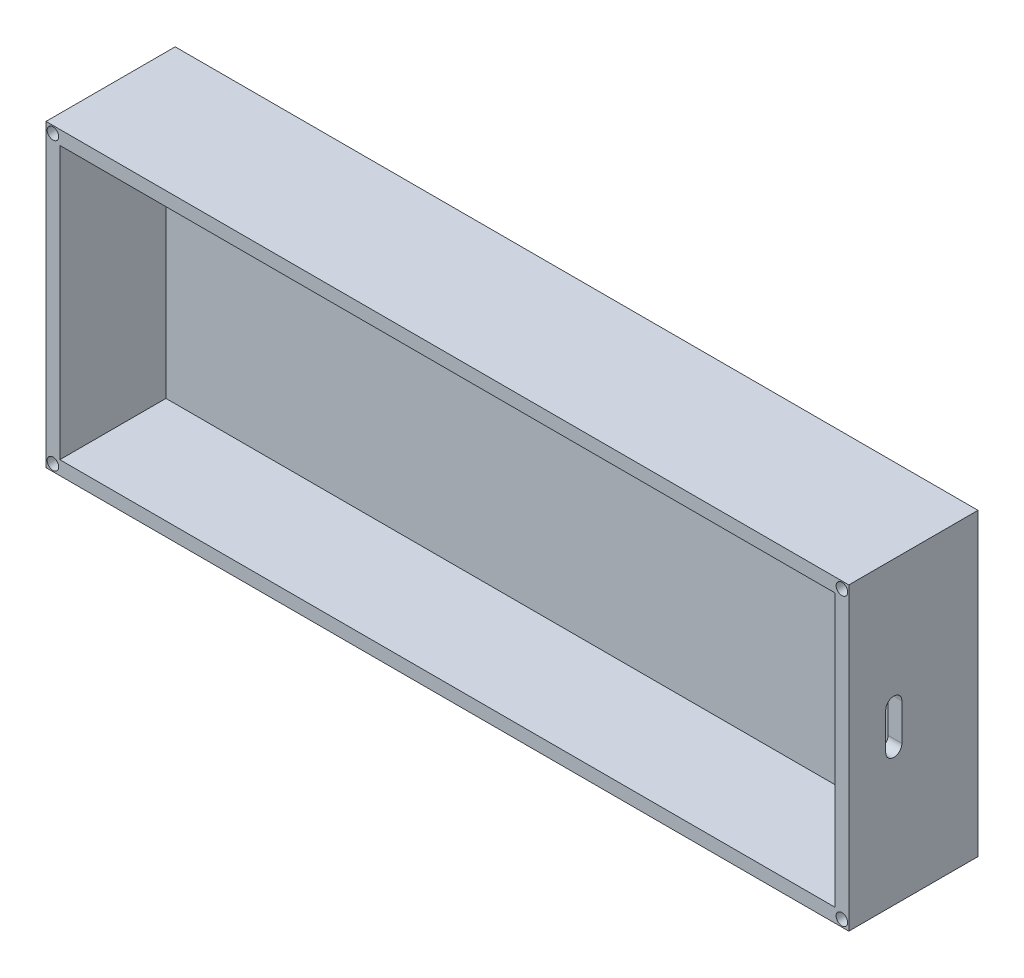
ISO-10303-21;
HEADER;
FILE_DESCRIPTION(('STEP AP214'),'2;1');
FILE_NAME('part.step','',(''),(''),'','','');
FILE_SCHEMA(('AUTOMOTIVE_DESIGN { 1 0 10303 214 1 1 1 1 }'));
ENDSEC;
DATA;
#1=APPLICATION_CONTEXT('core data for automotive mechanical design processes');
#2=APPLICATION_PROTOCOL_DEFINITION('international standard','automotive_design',2000,#1);
#3=PRODUCT_CONTEXT('',#1,'mechanical');
#4=PRODUCT('Part','Part','',(#3));
#5=PRODUCT_RELATED_PRODUCT_CATEGORY('part','',(#4));
#6=PRODUCT_DEFINITION_FORMATION('','',#4);
#7=PRODUCT_DEFINITION_CONTEXT('part definition',#1,'design');
#8=PRODUCT_DEFINITION('design','',#6,#7);
#9=PRODUCT_DEFINITION_SHAPE('','',#8);
#10=(LENGTH_UNIT() NAMED_UNIT(*) SI_UNIT(.MILLI.,.METRE.));
#11=(NAMED_UNIT(*) PLANE_ANGLE_UNIT() SI_UNIT($,.RADIAN.));
#12=(NAMED_UNIT(*) SI_UNIT($,.STERADIAN.) SOLID_ANGLE_UNIT());
#13=UNCERTAINTY_MEASURE_WITH_UNIT(LENGTH_MEASURE(1.E-05),#10,'distance_accuracy_value','');
#14=(GEOMETRIC_REPRESENTATION_CONTEXT(3) GLOBAL_UNCERTAINTY_ASSIGNED_CONTEXT((#13)) GLOBAL_UNIT_ASSIGNED_CONTEXT((#10,
#11,#12)) REPRESENTATION_CONTEXT('',''));
#15=CARTESIAN_POINT('',(0.,0.,0.));
#16=DIRECTION('',(0.,0.,1.));
#17=DIRECTION('',(1.,0.,0.));
#18=AXIS2_PLACEMENT_3D('',#15,#16,#17);
#19=CARTESIAN_POINT('',(-87.,-32.5,5.));
#20=DIRECTION('',(1.,0.,0.));
#21=DIRECTION('',(0.,0.,-1.));
#22=AXIS2_PLACEMENT_3D('',#19,#20,#21);
#23=PLANE('',#22);
#24=DIRECTION('',(0.,-1.,0.));
#25=VECTOR('',#24,1.);
#26=CARTESIAN_POINT('',(-87.,-32.5,0.));
#27=LINE('',#26,#25);
#28=CARTESIAN_POINT('',(-87.,32.5,0.));
#29=VERTEX_POINT('',#28);
#30=CARTESIAN_POINT('',(-87.,-32.5,0.));
#31=VERTEX_POINT('',#30);
#32=EDGE_CURVE('E197',#29,#31,#27,.T.);
#33=ORIENTED_EDGE('',*,*,#32,.T.);
#34=DIRECTION('',(0.,0.,-1.));
#35=VECTOR('',#34,1.);
#36=CARTESIAN_POINT('',(-87.,-32.5,5.));
#37=LINE('',#36,#35);
#38=CARTESIAN_POINT('',(-87.,-32.5,28.));
#39=VERTEX_POINT('',#38);
#40=EDGE_CURVE('E215',#39,#31,#37,.T.);
#41=ORIENTED_EDGE('',*,*,#40,.F.);
#42=DIRECTION('',(0.,-1.,0.));
#43=VECTOR('',#42,1.);
#44=CARTESIAN_POINT('',(-87.,0.,28.));
#45=LINE('',#44,#43);
#46=CARTESIAN_POINT('',(-87.,32.5,28.));
#47=VERTEX_POINT('',#46);
#48=EDGE_CURVE('E170',#47,#39,#45,.T.);
#49=ORIENTED_EDGE('',*,*,#48,.F.);
#50=DIRECTION('',(0.,0.,-1.));
#51=VECTOR('',#50,1.);
#52=CARTESIAN_POINT('',(-87.,32.5,5.));
#53=LINE('',#52,#51);
#54=EDGE_CURVE('E206',#47,#29,#53,.T.);
#55=ORIENTED_EDGE('',*,*,#54,.T.);
#56=EDGE_LOOP('',(#33,#41,#49,#55));
#57=FACE_BOUND('',#56,.T.);
#58=ADVANCED_FACE('F38',(#57),#23,.F.);
#59=CARTESIAN_POINT('',(87.,-32.5,5.));
#60=DIRECTION('',(0.,1.,0.));
#61=DIRECTION('',(-1.,0.,0.));
#62=AXIS2_PLACEMENT_3D('',#59,#60,#61);
#63=PLANE('',#62);
#64=DIRECTION('',(1.,0.,0.));
#65=VECTOR('',#64,1.);
#66=CARTESIAN_POINT('',(87.,-32.5,0.));
#67=LINE('',#66,#65);
#68=CARTESIAN_POINT('',(87.,-32.5,0.));
#69=VERTEX_POINT('',#68);
#70=EDGE_CURVE('E200',#31,#69,#67,.T.);
#71=ORIENTED_EDGE('',*,*,#70,.T.);
#72=DIRECTION('',(0.,0.,-1.));
#73=VECTOR('',#72,1.);
#74=CARTESIAN_POINT('',(87.,-32.5,5.));
#75=LINE('',#74,#73);
#76=CARTESIAN_POINT('',(87.,-32.5,28.));
#77=VERTEX_POINT('',#76);
#78=EDGE_CURVE('E212',#77,#69,#75,.T.);
#79=ORIENTED_EDGE('',*,*,#78,.F.);
#80=DIRECTION('',(1.,0.,0.));
#81=VECTOR('',#80,1.);
#82=CARTESIAN_POINT('',(0.,-32.5,28.));
#83=LINE('',#82,#81);
#84=EDGE_CURVE('E173',#39,#77,#83,.T.);
#85=ORIENTED_EDGE('',*,*,#84,.F.);
#86=ORIENTED_EDGE('',*,*,#40,.T.);
#87=EDGE_LOOP('',(#71,#79,#85,#86));
#88=FACE_BOUND('',#87,.T.);
#89=ADVANCED_FACE('F280',(#88),#63,.F.);
#90=CARTESIAN_POINT('',(87.,-32.5,5.));
#91=DIRECTION('',(-1.,0.,0.));
#92=DIRECTION('',(0.,0.,1.));
#93=AXIS2_PLACEMENT_3D('',#90,#91,#92);
#94=PLANE('',#93);
#95=DIRECTION('',(0.,1.,0.));
#96=VECTOR('',#95,1.);
#97=CARTESIAN_POINT('',(87.,-2.99999999999999,16.5));
#98=LINE('',#97,#96);
#99=CARTESIAN_POINT('',(87.,-2.99999999999999,16.5));
#100=VERTEX_POINT('',#99);
#101=CARTESIAN_POINT('',(87.,5.00000000000001,16.5));
#102=VERTEX_POINT('',#101);
#103=EDGE_CURVE('E137',#100,#102,#98,.T.);
#104=ORIENTED_EDGE('',*,*,#103,.F.);
#105=CARTESIAN_POINT('',(87.,-2.99999999999999,18.25));
#106=DIRECTION('',(1.,0.,0.));
#107=DIRECTION('',(0.,0.,-1.));
#108=AXIS2_PLACEMENT_3D('',#105,#106,#107);
#109=CIRCLE('',#108,1.75);
#110=CARTESIAN_POINT('',(87.,-2.99999999999999,20.));
#111=VERTEX_POINT('',#110);
#112=EDGE_CURVE('E52',#111,#100,#109,.T.);
#113=ORIENTED_EDGE('',*,*,#112,.F.);
#114=DIRECTION('',(0.,-1.,0.));
#115=VECTOR('',#114,1.);
#116=CARTESIAN_POINT('',(87.,-2.99999999999999,20.));
#117=LINE('',#116,#115);
#118=CARTESIAN_POINT('',(87.,5.00000000000001,20.));
#119=VERTEX_POINT('',#118);
#120=EDGE_CURVE('E144',#119,#111,#117,.T.);
#121=ORIENTED_EDGE('',*,*,#120,.F.);
#122=CARTESIAN_POINT('',(87.,5.00000000000001,18.25));
#123=DIRECTION('',(1.,0.,0.));
#124=DIRECTION('',(0.,0.,-1.));
#125=AXIS2_PLACEMENT_3D('',#122,#123,#124);
#126=CIRCLE('',#125,1.75);
#127=EDGE_CURVE('E128',#102,#119,#126,.T.);
#128=ORIENTED_EDGE('',*,*,#127,.F.);
#129=EDGE_LOOP('',(#104,#113,#121,#128));
#130=FACE_BOUND('',#129,.T.);
#131=DIRECTION('',(0.,1.,0.));
#132=VECTOR('',#131,1.);
#133=CARTESIAN_POINT('',(87.,-32.5,0.));
#134=LINE('',#133,#132);
#135=CARTESIAN_POINT('',(87.,32.5,0.));
#136=VERTEX_POINT('',#135);
#137=EDGE_CURVE('E202',#69,#136,#134,.T.);
#138=ORIENTED_EDGE('',*,*,#137,.T.);
#139=DIRECTION('',(0.,0.,-1.));
#140=VECTOR('',#139,1.);
#141=CARTESIAN_POINT('',(87.,32.5,5.));
#142=LINE('',#141,#140);
#143=CARTESIAN_POINT('',(87.,32.5,28.));
#144=VERTEX_POINT('',#143);
#145=EDGE_CURVE('E209',#144,#136,#142,.T.);
#146=ORIENTED_EDGE('',*,*,#145,.F.);
#147=DIRECTION('',(0.,1.,0.));
#148=VECTOR('',#147,1.);
#149=CARTESIAN_POINT('',(87.,0.,28.));
#150=LINE('',#149,#148);
#151=EDGE_CURVE('E176',#77,#144,#150,.T.);
#152=ORIENTED_EDGE('',*,*,#151,.F.);
#153=ORIENTED_EDGE('',*,*,#78,.T.);
#154=EDGE_LOOP('',(#138,#146,#152,#153));
#155=FACE_BOUND('',#154,.T.);
#156=ADVANCED_FACE('F141',(#130,#155),#94,.F.);
#157=CARTESIAN_POINT('',(87.,32.5,5.));
#158=DIRECTION('',(0.,-1.,0.));
#159=DIRECTION('',(1.,0.,0.));
#160=AXIS2_PLACEMENT_3D('',#157,#158,#159);
#161=PLANE('',#160);
#162=DIRECTION('',(-1.,0.,0.));
#163=VECTOR('',#162,1.);
#164=CARTESIAN_POINT('',(87.,32.5,0.));
#165=LINE('',#164,#163);
#166=EDGE_CURVE('E204',#136,#29,#165,.T.);
#167=ORIENTED_EDGE('',*,*,#166,.T.);
#168=ORIENTED_EDGE('',*,*,#54,.F.);
#169=DIRECTION('',(-1.,0.,0.));
#170=VECTOR('',#169,1.);
#171=CARTESIAN_POINT('',(0.,32.5,28.));
#172=LINE('',#171,#170);
#173=EDGE_CURVE('E167',#144,#47,#172,.T.);
#174=ORIENTED_EDGE('',*,*,#173,.F.);
#175=ORIENTED_EDGE('',*,*,#145,.T.);
#176=EDGE_LOOP('',(#167,#168,#174,#175));
#177=FACE_BOUND('',#176,.T.);
#178=ADVANCED_FACE('F275',(#177),#161,.F.);
#179=CARTESIAN_POINT('',(0.,0.,0.));
#180=DIRECTION('',(0.,0.,1.));
#181=DIRECTION('',(1.,0.,0.));
#182=AXIS2_PLACEMENT_3D('',#179,#180,#181);
#183=PLANE('',#182);
#184=ORIENTED_EDGE('',*,*,#32,.F.);
#185=ORIENTED_EDGE('',*,*,#166,.F.);
#186=ORIENTED_EDGE('',*,*,#137,.F.);
#187=ORIENTED_EDGE('',*,*,#70,.F.);
#188=EDGE_LOOP('',(#184,#185,#186,#187));
#189=FACE_BOUND('',#188,.T.);
#190=ADVANCED_FACE('F283',(#189),#183,.F.);
#191=CARTESIAN_POINT('',(0.,29.5,28.));
#192=DIRECTION('',(0.,-1.,0.));
#193=DIRECTION('',(1.,0.,0.));
#194=AXIS2_PLACEMENT_3D('',#191,#192,#193);
#195=PLANE('',#194);
#196=DIRECTION('',(-1.,0.,0.));
#197=VECTOR('',#196,1.);
#198=CARTESIAN_POINT('',(0.,29.5,5.));
#199=LINE('',#198,#197);
#200=CARTESIAN_POINT('',(84.,29.5,5.));
#201=VERTEX_POINT('',#200);
#202=CARTESIAN_POINT('',(-84.,29.5,5.));
#203=VERTEX_POINT('',#202);
#204=EDGE_CURVE('E151',#201,#203,#199,.T.);
#205=ORIENTED_EDGE('',*,*,#204,.F.);
#206=DIRECTION('',(0.,0.,-1.));
#207=VECTOR('',#206,1.);
#208=CARTESIAN_POINT('',(84.,29.5,28.));
#209=LINE('',#208,#207);
#210=CARTESIAN_POINT('',(84.,29.5,28.));
#211=VERTEX_POINT('',#210);
#212=EDGE_CURVE('E194',#211,#201,#209,.T.);
#213=ORIENTED_EDGE('',*,*,#212,.F.);
#214=DIRECTION('',(-1.,0.,0.));
#215=VECTOR('',#214,1.);
#216=CARTESIAN_POINT('',(0.,29.5,28.));
#217=LINE('',#216,#215);
#218=CARTESIAN_POINT('',(-84.,29.5,28.));
#219=VERTEX_POINT('',#218);
#220=EDGE_CURVE('E154',#211,#219,#217,.T.);
#221=ORIENTED_EDGE('',*,*,#220,.T.);
#222=DIRECTION('',(0.,0.,-1.));
#223=VECTOR('',#222,1.);
#224=CARTESIAN_POINT('',(-84.,29.5,28.));
#225=LINE('',#224,#223);
#226=EDGE_CURVE('E179',#219,#203,#225,.T.);
#227=ORIENTED_EDGE('',*,*,#226,.T.);
#228=EDGE_LOOP('',(#205,#213,#221,#227));
#229=FACE_BOUND('',#228,.T.);
#230=ADVANCED_FACE('F285',(#229),#195,.T.);
#231=CARTESIAN_POINT('',(84.,0.,28.));
#232=DIRECTION('',(-1.,0.,0.));
#233=DIRECTION('',(0.,0.,1.));
#234=AXIS2_PLACEMENT_3D('',#231,#232,#233);
#235=PLANE('',#234);
#236=CARTESIAN_POINT('',(84.,-2.99999999999999,18.25));
#237=DIRECTION('',(-1.,0.,0.));
#238=DIRECTION('',(0.,0.,1.));
#239=AXIS2_PLACEMENT_3D('',#236,#237,#238);
#240=CIRCLE('',#239,1.75);
#241=CARTESIAN_POINT('',(84.,-2.99999999999999,16.5));
#242=VERTEX_POINT('',#241);
#243=CARTESIAN_POINT('',(84.,-2.99999999999999,20.));
#244=VERTEX_POINT('',#243);
#245=EDGE_CURVE('E11',#242,#244,#240,.T.);
#246=ORIENTED_EDGE('',*,*,#245,.F.);
#247=DIRECTION('',(0.,-1.,0.));
#248=VECTOR('',#247,1.);
#249=CARTESIAN_POINT('',(84.,0.,16.5));
#250=LINE('',#249,#248);
#251=CARTESIAN_POINT('',(84.,5.00000000000001,16.5));
#252=VERTEX_POINT('',#251);
#253=EDGE_CURVE('E218',#252,#242,#250,.T.);
#254=ORIENTED_EDGE('',*,*,#253,.F.);
#255=CARTESIAN_POINT('',(84.,5.00000000000001,18.25));
#256=DIRECTION('',(-1.,0.,0.));
#257=DIRECTION('',(0.,0.,1.));
#258=AXIS2_PLACEMENT_3D('',#255,#256,#257);
#259=CIRCLE('',#258,1.75);
#260=CARTESIAN_POINT('',(84.,5.00000000000001,20.));
#261=VERTEX_POINT('',#260);
#262=EDGE_CURVE('E131',#261,#252,#259,.T.);
#263=ORIENTED_EDGE('',*,*,#262,.F.);
#264=DIRECTION('',(0.,1.,0.));
#265=VECTOR('',#264,1.);
#266=CARTESIAN_POINT('',(84.,0.,20.));
#267=LINE('',#266,#265);
#268=EDGE_CURVE('E45',#244,#261,#267,.T.);
#269=ORIENTED_EDGE('',*,*,#268,.F.);
#270=EDGE_LOOP('',(#246,#254,#263,#269));
#271=FACE_BOUND('',#270,.T.);
#272=DIRECTION('',(0.,1.,0.));
#273=VECTOR('',#272,1.);
#274=CARTESIAN_POINT('',(84.,0.,5.));
#275=LINE('',#274,#273);
#276=CARTESIAN_POINT('',(84.,-29.5,5.));
#277=VERTEX_POINT('',#276);
#278=EDGE_CURVE('E181',#277,#201,#275,.T.);
#279=ORIENTED_EDGE('',*,*,#278,.F.);
#280=DIRECTION('',(0.,0.,-1.));
#281=VECTOR('',#280,1.);
#282=CARTESIAN_POINT('',(84.,-29.5,28.));
#283=LINE('',#282,#281);
#284=CARTESIAN_POINT('',(84.,-29.5,28.));
#285=VERTEX_POINT('',#284);
#286=EDGE_CURVE('E191',#285,#277,#283,.T.);
#287=ORIENTED_EDGE('',*,*,#286,.F.);
#288=DIRECTION('',(0.,1.,0.));
#289=VECTOR('',#288,1.);
#290=CARTESIAN_POINT('',(84.,0.,28.));
#291=LINE('',#290,#289);
#292=EDGE_CURVE('E157',#285,#211,#291,.T.);
#293=ORIENTED_EDGE('',*,*,#292,.T.);
#294=ORIENTED_EDGE('',*,*,#212,.T.);
#295=EDGE_LOOP('',(#279,#287,#293,#294));
#296=FACE_BOUND('',#295,.T.);
#297=ADVANCED_FACE('F226',(#271,#296),#235,.T.);
#298=CARTESIAN_POINT('',(0.,-29.5,28.));
#299=DIRECTION('',(0.,1.,0.));
#300=DIRECTION('',(-1.,0.,0.));
#301=AXIS2_PLACEMENT_3D('',#298,#299,#300);
#302=PLANE('',#301);
#303=DIRECTION('',(1.,0.,0.));
#304=VECTOR('',#303,1.);
#305=CARTESIAN_POINT('',(0.,-29.5,5.));
#306=LINE('',#305,#304);
#307=CARTESIAN_POINT('',(-84.,-29.5,5.));
#308=VERTEX_POINT('',#307);
#309=EDGE_CURVE('E183',#308,#277,#306,.T.);
#310=ORIENTED_EDGE('',*,*,#309,.F.);
#311=DIRECTION('',(0.,0.,-1.));
#312=VECTOR('',#311,1.);
#313=CARTESIAN_POINT('',(-84.,-29.5,28.));
#314=LINE('',#313,#312);
#315=CARTESIAN_POINT('',(-84.,-29.5,28.));
#316=VERTEX_POINT('',#315);
#317=EDGE_CURVE('E188',#316,#308,#314,.T.);
#318=ORIENTED_EDGE('',*,*,#317,.F.);
#319=DIRECTION('',(1.,0.,0.));
#320=VECTOR('',#319,1.);
#321=CARTESIAN_POINT('',(0.,-29.5,28.));
#322=LINE('',#321,#320);
#323=EDGE_CURVE('E161',#316,#285,#322,.T.);
#324=ORIENTED_EDGE('',*,*,#323,.T.);
#325=ORIENTED_EDGE('',*,*,#286,.T.);
#326=EDGE_LOOP('',(#310,#318,#324,#325));
#327=FACE_BOUND('',#326,.T.);
#328=ADVANCED_FACE('F328',(#327),#302,.T.);
#329=CARTESIAN_POINT('',(-84.,0.,28.));
#330=DIRECTION('',(1.,0.,0.));
#331=DIRECTION('',(0.,0.,-1.));
#332=AXIS2_PLACEMENT_3D('',#329,#330,#331);
#333=PLANE('',#332);
#334=DIRECTION('',(0.,-1.,0.));
#335=VECTOR('',#334,1.);
#336=CARTESIAN_POINT('',(-84.,0.,5.));
#337=LINE('',#336,#335);
#338=EDGE_CURVE('E158',#203,#308,#337,.T.);
#339=ORIENTED_EDGE('',*,*,#338,.F.);
#340=ORIENTED_EDGE('',*,*,#226,.F.);
#341=DIRECTION('',(0.,-1.,0.));
#342=VECTOR('',#341,1.);
#343=CARTESIAN_POINT('',(-84.,0.,28.));
#344=LINE('',#343,#342);
#345=EDGE_CURVE('E164',#219,#316,#344,.T.);
#346=ORIENTED_EDGE('',*,*,#345,.T.);
#347=ORIENTED_EDGE('',*,*,#317,.T.);
#348=EDGE_LOOP('',(#339,#340,#346,#347));
#349=FACE_BOUND('',#348,.T.);
#350=ADVANCED_FACE('F261',(#349),#333,.T.);
#351=CARTESIAN_POINT('',(0.,0.,28.));
#352=DIRECTION('',(0.,0.,1.));
#353=DIRECTION('',(1.,0.,0.));
#354=AXIS2_PLACEMENT_3D('',#351,#352,#353);
#355=PLANE('',#354);
#356=CARTESIAN_POINT('',(85.5,-31.,28.));
#357=DIRECTION('',(0.,0.,1.));
#358=DIRECTION('',(1.,0.,0.));
#359=AXIS2_PLACEMENT_3D('',#356,#357,#358);
#360=CIRCLE('',#359,1.25);
#361=CARTESIAN_POINT('',(86.75,-31.,28.));
#362=VERTEX_POINT('',#361);
#363=EDGE_CURVE('E240',#362,#362,#360,.T.);
#364=ORIENTED_EDGE('',*,*,#363,.F.);
#365=EDGE_LOOP('',(#364));
#366=FACE_BOUND('',#365,.T.);
#367=CARTESIAN_POINT('',(85.5,31.,28.));
#368=DIRECTION('',(0.,0.,1.));
#369=DIRECTION('',(1.,0.,0.));
#370=AXIS2_PLACEMENT_3D('',#367,#368,#369);
#371=CIRCLE('',#370,1.25);
#372=CARTESIAN_POINT('',(86.75,31.,28.));
#373=VERTEX_POINT('',#372);
#374=EDGE_CURVE('E246',#373,#373,#371,.T.);
#375=ORIENTED_EDGE('',*,*,#374,.F.);
#376=EDGE_LOOP('',(#375));
#377=FACE_BOUND('',#376,.T.);
#378=CARTESIAN_POINT('',(-85.5,31.,28.));
#379=DIRECTION('',(0.,0.,1.));
#380=DIRECTION('',(1.,0.,0.));
#381=AXIS2_PLACEMENT_3D('',#378,#379,#380);
#382=CIRCLE('',#381,1.25);
#383=CARTESIAN_POINT('',(-84.25,31.,28.));
#384=VERTEX_POINT('',#383);
#385=EDGE_CURVE('E235',#384,#384,#382,.T.);
#386=ORIENTED_EDGE('',*,*,#385,.F.);
#387=EDGE_LOOP('',(#386));
#388=FACE_BOUND('',#387,.T.);
#389=CARTESIAN_POINT('',(-85.5,-31.,28.));
#390=DIRECTION('',(0.,0.,1.));
#391=DIRECTION('',(1.,0.,0.));
#392=AXIS2_PLACEMENT_3D('',#389,#390,#391);
#393=CIRCLE('',#392,1.25);
#394=CARTESIAN_POINT('',(-84.25,-31.,28.));
#395=VERTEX_POINT('',#394);
#396=EDGE_CURVE('E231',#395,#395,#393,.T.);
#397=ORIENTED_EDGE('',*,*,#396,.F.);
#398=EDGE_LOOP('',(#397));
#399=FACE_BOUND('',#398,.T.);
#400=ORIENTED_EDGE('',*,*,#220,.F.);
#401=ORIENTED_EDGE('',*,*,#292,.F.);
#402=ORIENTED_EDGE('',*,*,#323,.F.);
#403=ORIENTED_EDGE('',*,*,#345,.F.);
#404=EDGE_LOOP('',(#400,#401,#402,#403));
#405=FACE_BOUND('',#404,.T.);
#406=ORIENTED_EDGE('',*,*,#173,.T.);
#407=ORIENTED_EDGE('',*,*,#48,.T.);
#408=ORIENTED_EDGE('',*,*,#84,.T.);
#409=ORIENTED_EDGE('',*,*,#151,.T.);
#410=EDGE_LOOP('',(#406,#407,#408,#409));
#411=FACE_BOUND('',#410,.T.);
#412=ADVANCED_FACE('F257',(#366,#377,#388,#399,#405,#411),#355,.T.);
#413=CARTESIAN_POINT('',(0.,0.,5.));
#414=DIRECTION('',(0.,0.,1.));
#415=DIRECTION('',(1.,0.,0.));
#416=AXIS2_PLACEMENT_3D('',#413,#414,#415);
#417=PLANE('',#416);
#418=ORIENTED_EDGE('',*,*,#204,.T.);
#419=ORIENTED_EDGE('',*,*,#338,.T.);
#420=ORIENTED_EDGE('',*,*,#309,.T.);
#421=ORIENTED_EDGE('',*,*,#278,.T.);
#422=EDGE_LOOP('',(#418,#419,#420,#421));
#423=FACE_BOUND('',#422,.T.);
#424=ADVANCED_FACE('F260',(#423),#417,.T.);
#425=CARTESIAN_POINT('',(64.,-2.99999999999999,18.25));
#426=DIRECTION('',(1.,0.,0.));
#427=DIRECTION('',(0.,0.,-1.));
#428=AXIS2_PLACEMENT_3D('',#425,#426,#427);
#429=CYLINDRICAL_SURFACE('',#428,1.75);
#430=ORIENTED_EDGE('',*,*,#245,.T.);
#431=DIRECTION('',(1.,0.,0.));
#432=VECTOR('',#431,1.);
#433=CARTESIAN_POINT('',(64.,-2.99999999999999,20.));
#434=LINE('',#433,#432);
#435=EDGE_CURVE('E149',#244,#111,#434,.T.);
#436=ORIENTED_EDGE('',*,*,#435,.T.);
#437=ORIENTED_EDGE('',*,*,#112,.T.);
#438=DIRECTION('',(1.,0.,0.));
#439=VECTOR('',#438,1.);
#440=CARTESIAN_POINT('',(64.,-2.99999999999999,16.5));
#441=LINE('',#440,#439);
#442=EDGE_CURVE('E134',#242,#100,#441,.T.);
#443=ORIENTED_EDGE('',*,*,#442,.F.);
#444=EDGE_LOOP('',(#430,#436,#437,#443));
#445=FACE_BOUND('',#444,.T.);
#446=ADVANCED_FACE('F228',(#445),#429,.F.);
#447=CARTESIAN_POINT('',(64.,-2.99999999999999,20.));
#448=DIRECTION('',(0.,0.,1.));
#449=DIRECTION('',(1.,0.,0.));
#450=AXIS2_PLACEMENT_3D('',#447,#448,#449);
#451=PLANE('',#450);
#452=ORIENTED_EDGE('',*,*,#268,.T.);
#453=DIRECTION('',(1.,0.,0.));
#454=VECTOR('',#453,1.);
#455=CARTESIAN_POINT('',(64.,5.00000000000001,20.));
#456=LINE('',#455,#454);
#457=EDGE_CURVE('E133',#261,#119,#456,.T.);
#458=ORIENTED_EDGE('',*,*,#457,.T.);
#459=ORIENTED_EDGE('',*,*,#120,.T.);
#460=ORIENTED_EDGE('',*,*,#435,.F.);
#461=EDGE_LOOP('',(#452,#458,#459,#460));
#462=FACE_BOUND('',#461,.T.);
#463=ADVANCED_FACE('F223',(#462),#451,.F.);
#464=CARTESIAN_POINT('',(64.,5.00000000000001,18.25));
#465=DIRECTION('',(1.,0.,0.));
#466=DIRECTION('',(0.,0.,-1.));
#467=AXIS2_PLACEMENT_3D('',#464,#465,#466);
#468=CYLINDRICAL_SURFACE('',#467,1.75);
#469=ORIENTED_EDGE('',*,*,#262,.T.);
#470=DIRECTION('',(1.,0.,0.));
#471=VECTOR('',#470,1.);
#472=CARTESIAN_POINT('',(64.,5.00000000000001,16.5));
#473=LINE('',#472,#471);
#474=EDGE_CURVE('E60',#252,#102,#473,.T.);
#475=ORIENTED_EDGE('',*,*,#474,.T.);
#476=ORIENTED_EDGE('',*,*,#127,.T.);
#477=ORIENTED_EDGE('',*,*,#457,.F.);
#478=EDGE_LOOP('',(#469,#475,#476,#477));
#479=FACE_BOUND('',#478,.T.);
#480=ADVANCED_FACE('F125',(#479),#468,.F.);
#481=CARTESIAN_POINT('',(64.,-2.99999999999999,16.5));
#482=DIRECTION('',(0.,0.,-1.));
#483=DIRECTION('',(-1.,0.,0.));
#484=AXIS2_PLACEMENT_3D('',#481,#482,#483);
#485=PLANE('',#484);
#486=ORIENTED_EDGE('',*,*,#253,.T.);
#487=ORIENTED_EDGE('',*,*,#442,.T.);
#488=ORIENTED_EDGE('',*,*,#103,.T.);
#489=ORIENTED_EDGE('',*,*,#474,.F.);
#490=EDGE_LOOP('',(#486,#487,#488,#489));
#491=FACE_BOUND('',#490,.T.);
#492=ADVANCED_FACE('F138',(#491),#485,.F.);
#493=CARTESIAN_POINT('',(-85.5,-31.,24.));
#494=DIRECTION('',(0.,0.,1.));
#495=DIRECTION('',(1.,0.,0.));
#496=AXIS2_PLACEMENT_3D('',#493,#494,#495);
#497=CYLINDRICAL_SURFACE('',#496,1.25);
#498=CARTESIAN_POINT('',(-85.5,-31.,24.));
#499=DIRECTION('',(0.,0.,1.));
#500=DIRECTION('',(1.,0.,0.));
#501=AXIS2_PLACEMENT_3D('',#498,#499,#500);
#502=CIRCLE('',#501,1.25);
#503=CARTESIAN_POINT('',(-84.25,-31.,24.));
#504=VERTEX_POINT('',#503);
#505=EDGE_CURVE('E229',#504,#504,#502,.T.);
#506=ORIENTED_EDGE('',*,*,#505,.F.);
#507=EDGE_LOOP('',(#506));
#508=FACE_BOUND('',#507,.T.);
#509=ORIENTED_EDGE('',*,*,#396,.T.);
#510=EDGE_LOOP('',(#509));
#511=FACE_BOUND('',#510,.T.);
#512=ADVANCED_FACE('F383',(#508,#511),#497,.F.);
#513=CARTESIAN_POINT('',(-85.5,-31.,24.));
#514=DIRECTION('',(0.,0.,1.));
#515=DIRECTION('',(1.,0.,0.));
#516=AXIS2_PLACEMENT_3D('',#513,#514,#515);
#517=PLANE('',#516);
#518=ORIENTED_EDGE('',*,*,#505,.T.);
#519=EDGE_LOOP('',(#518));
#520=FACE_BOUND('',#519,.T.);
#521=ADVANCED_FACE('F390',(#520),#517,.T.);
#522=CARTESIAN_POINT('',(-85.5,31.,24.));
#523=DIRECTION('',(0.,0.,1.));
#524=DIRECTION('',(1.,0.,0.));
#525=AXIS2_PLACEMENT_3D('',#522,#523,#524);
#526=CYLINDRICAL_SURFACE('',#525,1.25);
#527=CARTESIAN_POINT('',(-85.5,31.,24.));
#528=DIRECTION('',(0.,0.,1.));
#529=DIRECTION('',(1.,0.,0.));
#530=AXIS2_PLACEMENT_3D('',#527,#528,#529);
#531=CIRCLE('',#530,1.25);
#532=CARTESIAN_POINT('',(-84.25,31.,24.));
#533=VERTEX_POINT('',#532);
#534=EDGE_CURVE('E249',#533,#533,#531,.T.);
#535=ORIENTED_EDGE('',*,*,#534,.F.);
#536=EDGE_LOOP('',(#535));
#537=FACE_BOUND('',#536,.T.);
#538=ORIENTED_EDGE('',*,*,#385,.T.);
#539=EDGE_LOOP('',(#538));
#540=FACE_BOUND('',#539,.T.);
#541=ADVANCED_FACE('F255',(#537,#540),#526,.F.);
#542=CARTESIAN_POINT('',(-85.5,31.,24.));
#543=DIRECTION('',(0.,0.,1.));
#544=DIRECTION('',(1.,0.,0.));
#545=AXIS2_PLACEMENT_3D('',#542,#543,#544);
#546=PLANE('',#545);
#547=ORIENTED_EDGE('',*,*,#534,.T.);
#548=EDGE_LOOP('',(#547));
#549=FACE_BOUND('',#548,.T.);
#550=ADVANCED_FACE('F405',(#549),#546,.T.);
#551=CARTESIAN_POINT('',(85.5,31.,24.));
#552=DIRECTION('',(0.,0.,1.));
#553=DIRECTION('',(1.,0.,0.));
#554=AXIS2_PLACEMENT_3D('',#551,#552,#553);
#555=CYLINDRICAL_SURFACE('',#554,1.25);
#556=CARTESIAN_POINT('',(85.5,31.,24.));
#557=DIRECTION('',(0.,0.,1.));
#558=DIRECTION('',(1.,0.,0.));
#559=AXIS2_PLACEMENT_3D('',#556,#557,#558);
#560=CIRCLE('',#559,1.25);
#561=CARTESIAN_POINT('',(86.75,31.,24.));
#562=VERTEX_POINT('',#561);
#563=EDGE_CURVE('E243',#562,#562,#560,.T.);
#564=ORIENTED_EDGE('',*,*,#563,.F.);
#565=EDGE_LOOP('',(#564));
#566=FACE_BOUND('',#565,.T.);
#567=ORIENTED_EDGE('',*,*,#374,.T.);
#568=EDGE_LOOP('',(#567));
#569=FACE_BOUND('',#568,.T.);
#570=ADVANCED_FACE('F413',(#566,#569),#555,.F.);
#571=CARTESIAN_POINT('',(85.5,31.,24.));
#572=DIRECTION('',(0.,0.,1.));
#573=DIRECTION('',(1.,0.,0.));
#574=AXIS2_PLACEMENT_3D('',#571,#572,#573);
#575=PLANE('',#574);
#576=ORIENTED_EDGE('',*,*,#563,.T.);
#577=EDGE_LOOP('',(#576));
#578=FACE_BOUND('',#577,.T.);
#579=ADVANCED_FACE('F421',(#578),#575,.T.);
#580=CARTESIAN_POINT('',(85.5,-31.,24.));
#581=DIRECTION('',(0.,0.,1.));
#582=DIRECTION('',(1.,0.,0.));
#583=AXIS2_PLACEMENT_3D('',#580,#581,#582);
#584=CYLINDRICAL_SURFACE('',#583,1.25);
#585=CARTESIAN_POINT('',(85.5,-31.,24.));
#586=DIRECTION('',(0.,0.,1.));
#587=DIRECTION('',(1.,0.,0.));
#588=AXIS2_PLACEMENT_3D('',#585,#586,#587);
#589=CIRCLE('',#588,1.25);
#590=CARTESIAN_POINT('',(86.75,-31.,24.));
#591=VERTEX_POINT('',#590);
#592=EDGE_CURVE('E237',#591,#591,#589,.T.);
#593=ORIENTED_EDGE('',*,*,#592,.F.);
#594=EDGE_LOOP('',(#593));
#595=FACE_BOUND('',#594,.T.);
#596=ORIENTED_EDGE('',*,*,#363,.T.);
#597=EDGE_LOOP('',(#596));
#598=FACE_BOUND('',#597,.T.);
#599=ADVANCED_FACE('F429',(#595,#598),#584,.F.);
#600=CARTESIAN_POINT('',(85.5,-31.,24.));
#601=DIRECTION('',(0.,0.,1.));
#602=DIRECTION('',(1.,0.,0.));
#603=AXIS2_PLACEMENT_3D('',#600,#601,#602);
#604=PLANE('',#603);
#605=ORIENTED_EDGE('',*,*,#592,.T.);
#606=EDGE_LOOP('',(#605));
#607=FACE_BOUND('',#606,.T.);
#608=ADVANCED_FACE('F437',(#607),#604,.T.);
#609=CLOSED_SHELL('',(#58,#89,#156,#178,#190,#230,#297,#328,#350,#412,#424,#446,#463,#480,#492,
#512,#521,#541,#550,#570,#579,#599,#608));
#610=MANIFOLD_SOLID_BREP('B2',#609);
#611=ADVANCED_BREP_SHAPE_REPRESENTATION('',(#18,#610),#14);
#612=SHAPE_DEFINITION_REPRESENTATION(#9,#611);
ENDSEC;
END-ISO-10303-21;
